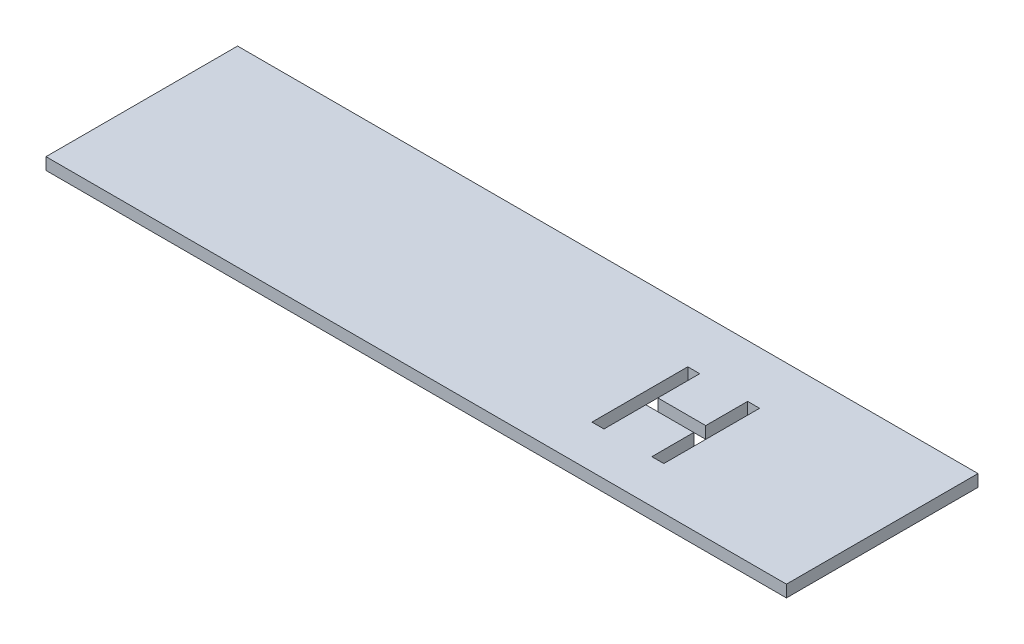
ISO-10303-21;
HEADER;
FILE_DESCRIPTION(('STEP AP214'),'2;1');
FILE_NAME('part.step','',(''),(''),'','','');
FILE_SCHEMA(('AUTOMOTIVE_DESIGN { 1 0 10303 214 1 1 1 1 }'));
ENDSEC;
DATA;
#1=APPLICATION_CONTEXT('core data for automotive mechanical design processes');
#2=APPLICATION_PROTOCOL_DEFINITION('international standard','automotive_design',2000,#1);
#3=PRODUCT_CONTEXT('',#1,'mechanical');
#4=PRODUCT('Part','Part','',(#3));
#5=PRODUCT_RELATED_PRODUCT_CATEGORY('part','',(#4));
#6=PRODUCT_DEFINITION_FORMATION('','',#4);
#7=PRODUCT_DEFINITION_CONTEXT('part definition',#1,'design');
#8=PRODUCT_DEFINITION('design','',#6,#7);
#9=PRODUCT_DEFINITION_SHAPE('','',#8);
#10=(LENGTH_UNIT() NAMED_UNIT(*) SI_UNIT(.MILLI.,.METRE.));
#11=(NAMED_UNIT(*) PLANE_ANGLE_UNIT() SI_UNIT($,.RADIAN.));
#12=(NAMED_UNIT(*) SI_UNIT($,.STERADIAN.) SOLID_ANGLE_UNIT());
#13=UNCERTAINTY_MEASURE_WITH_UNIT(LENGTH_MEASURE(1.E-05),#10,'distance_accuracy_value','');
#14=(GEOMETRIC_REPRESENTATION_CONTEXT(3) GLOBAL_UNCERTAINTY_ASSIGNED_CONTEXT((#13)) GLOBAL_UNIT_ASSIGNED_CONTEXT((#10,
#11,#12)) REPRESENTATION_CONTEXT('',''));
#15=CARTESIAN_POINT('',(0.,0.,0.));
#16=DIRECTION('',(0.,0.,1.));
#17=DIRECTION('',(1.,0.,0.));
#18=AXIS2_PLACEMENT_3D('',#15,#16,#17);
#19=CARTESIAN_POINT('',(0.,3.175,0.));
#20=DIRECTION('',(1.,0.,0.));
#21=DIRECTION('',(0.,0.,-1.));
#22=AXIS2_PLACEMENT_3D('',#19,#20,#21);
#23=PLANE('',#22);
#24=DIRECTION('',(0.,0.,1.));
#25=VECTOR('',#24,1.);
#26=CARTESIAN_POINT('',(0.,0.,0.));
#27=LINE('',#26,#25);
#28=CARTESIAN_POINT('',(0.,0.,-50.8));
#29=VERTEX_POINT('',#28);
#30=CARTESIAN_POINT('',(0.,0.,0.));
#31=VERTEX_POINT('',#30);
#32=EDGE_CURVE('E294',#29,#31,#27,.T.);
#33=ORIENTED_EDGE('',*,*,#32,.T.);
#34=DIRECTION('',(0.,-1.,0.));
#35=VECTOR('',#34,1.);
#36=CARTESIAN_POINT('',(0.,3.175,0.));
#37=LINE('',#36,#35);
#38=CARTESIAN_POINT('',(0.,3.175,0.));
#39=VERTEX_POINT('',#38);
#40=EDGE_CURVE('E11',#39,#31,#37,.T.);
#41=ORIENTED_EDGE('',*,*,#40,.F.);
#42=DIRECTION('',(0.,0.,1.));
#43=VECTOR('',#42,1.);
#44=CARTESIAN_POINT('',(0.,3.175,0.));
#45=LINE('',#44,#43);
#46=CARTESIAN_POINT('',(0.,3.175,-50.8));
#47=VERTEX_POINT('',#46);
#48=EDGE_CURVE('E295',#47,#39,#45,.T.);
#49=ORIENTED_EDGE('',*,*,#48,.F.);
#50=DIRECTION('',(0.,-1.,0.));
#51=VECTOR('',#50,1.);
#52=CARTESIAN_POINT('',(0.,3.175,-50.8));
#53=LINE('',#52,#51);
#54=EDGE_CURVE('E309',#47,#29,#53,.T.);
#55=ORIENTED_EDGE('',*,*,#54,.T.);
#56=EDGE_LOOP('',(#33,#41,#49,#55));
#57=FACE_BOUND('',#56,.T.);
#58=ADVANCED_FACE('F43',(#57),#23,.F.);
#59=CARTESIAN_POINT('',(0.,3.175,0.));
#60=DIRECTION('',(0.,0.,-1.));
#61=DIRECTION('',(-1.,0.,0.));
#62=AXIS2_PLACEMENT_3D('',#59,#60,#61);
#63=PLANE('',#62);
#64=DIRECTION('',(1.,0.,0.));
#65=VECTOR('',#64,1.);
#66=CARTESIAN_POINT('',(0.,0.,0.));
#67=LINE('',#66,#65);
#68=CARTESIAN_POINT('',(196.342,0.,0.));
#69=VERTEX_POINT('',#68);
#70=EDGE_CURVE('E313',#31,#69,#67,.T.);
#71=ORIENTED_EDGE('',*,*,#70,.T.);
#72=DIRECTION('',(0.,-1.,0.));
#73=VECTOR('',#72,1.);
#74=CARTESIAN_POINT('',(196.342,3.175,0.));
#75=LINE('',#74,#73);
#76=CARTESIAN_POINT('',(196.342,3.175,0.));
#77=VERTEX_POINT('',#76);
#78=EDGE_CURVE('E51',#77,#69,#75,.T.);
#79=ORIENTED_EDGE('',*,*,#78,.F.);
#80=DIRECTION('',(1.,0.,0.));
#81=VECTOR('',#80,1.);
#82=CARTESIAN_POINT('',(0.,3.175,0.));
#83=LINE('',#82,#81);
#84=EDGE_CURVE('E299',#39,#77,#83,.T.);
#85=ORIENTED_EDGE('',*,*,#84,.F.);
#86=ORIENTED_EDGE('',*,*,#40,.T.);
#87=EDGE_LOOP('',(#71,#79,#85,#86));
#88=FACE_BOUND('',#87,.T.);
#89=ADVANCED_FACE('F348',(#88),#63,.F.);
#90=CARTESIAN_POINT('',(196.342,3.175,0.));
#91=DIRECTION('',(-1.,0.,0.));
#92=DIRECTION('',(0.,0.,1.));
#93=AXIS2_PLACEMENT_3D('',#90,#91,#92);
#94=PLANE('',#93);
#95=DIRECTION('',(0.,0.,-1.));
#96=VECTOR('',#95,1.);
#97=CARTESIAN_POINT('',(196.342,0.,0.));
#98=LINE('',#97,#96);
#99=CARTESIAN_POINT('',(196.342,0.,-50.8));
#100=VERTEX_POINT('',#99);
#101=EDGE_CURVE('E316',#69,#100,#98,.T.);
#102=ORIENTED_EDGE('',*,*,#101,.T.);
#103=DIRECTION('',(0.,-1.,0.));
#104=VECTOR('',#103,1.);
#105=CARTESIAN_POINT('',(196.342,3.175,-50.8));
#106=LINE('',#105,#104);
#107=CARTESIAN_POINT('',(196.342,3.175,-50.8));
#108=VERTEX_POINT('',#107);
#109=EDGE_CURVE('E324',#108,#100,#106,.T.);
#110=ORIENTED_EDGE('',*,*,#109,.F.);
#111=DIRECTION('',(0.,0.,-1.));
#112=VECTOR('',#111,1.);
#113=CARTESIAN_POINT('',(196.342,3.175,0.));
#114=LINE('',#113,#112);
#115=EDGE_CURVE('E303',#77,#108,#114,.T.);
#116=ORIENTED_EDGE('',*,*,#115,.F.);
#117=ORIENTED_EDGE('',*,*,#78,.T.);
#118=EDGE_LOOP('',(#102,#110,#116,#117));
#119=FACE_BOUND('',#118,.T.);
#120=ADVANCED_FACE('F334',(#119),#94,.F.);
#121=CARTESIAN_POINT('',(0.,3.175,-50.8));
#122=DIRECTION('',(0.,0.,1.));
#123=DIRECTION('',(1.,0.,0.));
#124=AXIS2_PLACEMENT_3D('',#121,#122,#123);
#125=PLANE('',#124);
#126=DIRECTION('',(-1.,0.,0.));
#127=VECTOR('',#126,1.);
#128=CARTESIAN_POINT('',(0.,0.,-50.8));
#129=LINE('',#128,#127);
#130=EDGE_CURVE('E300',#100,#29,#129,.T.);
#131=ORIENTED_EDGE('',*,*,#130,.T.);
#132=ORIENTED_EDGE('',*,*,#54,.F.);
#133=DIRECTION('',(-1.,0.,0.));
#134=VECTOR('',#133,1.);
#135=CARTESIAN_POINT('',(0.,3.175,-50.8));
#136=LINE('',#135,#134);
#137=EDGE_CURVE('E306',#108,#47,#136,.T.);
#138=ORIENTED_EDGE('',*,*,#137,.F.);
#139=ORIENTED_EDGE('',*,*,#109,.T.);
#140=EDGE_LOOP('',(#131,#132,#138,#139));
#141=FACE_BOUND('',#140,.T.);
#142=ADVANCED_FACE('F341',(#141),#125,.F.);
#143=CARTESIAN_POINT('',(0.,3.175,0.));
#144=DIRECTION('',(0.,-1.,0.));
#145=DIRECTION('',(0.,0.,-1.));
#146=AXIS2_PLACEMENT_3D('',#143,#144,#145);
#147=PLANE('',#146);
#148=DIRECTION('',(-1.,0.,0.));
#149=VECTOR('',#148,1.);
#150=CARTESIAN_POINT('',(0.,3.175,-11.43));
#151=LINE('',#150,#149);
#152=CARTESIAN_POINT('',(136.525,3.175,-11.43));
#153=VERTEX_POINT('',#152);
#154=CARTESIAN_POINT('',(133.35,3.175,-11.43));
#155=VERTEX_POINT('',#154);
#156=EDGE_CURVE('E286',#153,#155,#151,.T.);
#157=ORIENTED_EDGE('',*,*,#156,.T.);
#158=DIRECTION('',(0.,0.,-1.));
#159=VECTOR('',#158,1.);
#160=CARTESIAN_POINT('',(133.35,3.175,0.));
#161=LINE('',#160,#159);
#162=CARTESIAN_POINT('',(133.35,3.175,-36.83));
#163=VERTEX_POINT('',#162);
#164=EDGE_CURVE('E290',#155,#163,#161,.T.);
#165=ORIENTED_EDGE('',*,*,#164,.T.);
#166=DIRECTION('',(1.,0.,0.));
#167=VECTOR('',#166,1.);
#168=CARTESIAN_POINT('',(0.,3.175,-36.83));
#169=LINE('',#168,#167);
#170=CARTESIAN_POINT('',(136.525,3.175,-36.83));
#171=VERTEX_POINT('',#170);
#172=EDGE_CURVE('E221',#163,#171,#169,.T.);
#173=ORIENTED_EDGE('',*,*,#172,.T.);
#174=DIRECTION('',(0.,0.,1.));
#175=VECTOR('',#174,1.);
#176=CARTESIAN_POINT('',(136.525,3.175,-3.40997071849155E-13));
#177=LINE('',#176,#175);
#178=CARTESIAN_POINT('',(136.525,3.175,-25.7175));
#179=VERTEX_POINT('',#178);
#180=EDGE_CURVE('E162',#171,#179,#177,.T.);
#181=ORIENTED_EDGE('',*,*,#180,.T.);
#182=DIRECTION('',(1.,0.,0.));
#183=VECTOR('',#182,1.);
#184=CARTESIAN_POINT('',(0.,3.175,-25.7175));
#185=LINE('',#184,#183);
#186=CARTESIAN_POINT('',(149.225,3.175,-25.7175));
#187=VERTEX_POINT('',#186);
#188=EDGE_CURVE('E254',#179,#187,#185,.T.);
#189=ORIENTED_EDGE('',*,*,#188,.T.);
#190=DIRECTION('',(0.,0.,-1.));
#191=VECTOR('',#190,1.);
#192=CARTESIAN_POINT('',(149.225,3.175,0.));
#193=LINE('',#192,#191);
#194=CARTESIAN_POINT('',(149.225,3.175,-36.83));
#195=VERTEX_POINT('',#194);
#196=EDGE_CURVE('E258',#187,#195,#193,.T.);
#197=ORIENTED_EDGE('',*,*,#196,.T.);
#198=DIRECTION('',(1.,0.,0.));
#199=VECTOR('',#198,1.);
#200=CARTESIAN_POINT('',(0.,3.175,-36.83));
#201=LINE('',#200,#199);
#202=CARTESIAN_POINT('',(152.4,3.175,-36.83));
#203=VERTEX_POINT('',#202);
#204=EDGE_CURVE('E262',#195,#203,#201,.T.);
#205=ORIENTED_EDGE('',*,*,#204,.T.);
#206=DIRECTION('',(0.,0.,1.));
#207=VECTOR('',#206,1.);
#208=CARTESIAN_POINT('',(152.4,3.175,0.));
#209=LINE('',#208,#207);
#210=CARTESIAN_POINT('',(152.4,3.175,-11.43));
#211=VERTEX_POINT('',#210);
#212=EDGE_CURVE('E266',#203,#211,#209,.T.);
#213=ORIENTED_EDGE('',*,*,#212,.T.);
#214=DIRECTION('',(-1.,0.,0.));
#215=VECTOR('',#214,1.);
#216=CARTESIAN_POINT('',(0.,3.175,-11.43));
#217=LINE('',#216,#215);
#218=CARTESIAN_POINT('',(149.225,3.175,-11.43));
#219=VERTEX_POINT('',#218);
#220=EDGE_CURVE('E270',#211,#219,#217,.T.);
#221=ORIENTED_EDGE('',*,*,#220,.T.);
#222=DIRECTION('',(0.,0.,-1.));
#223=VECTOR('',#222,1.);
#224=CARTESIAN_POINT('',(149.225,3.175,0.));
#225=LINE('',#224,#223);
#226=CARTESIAN_POINT('',(149.225,3.175,-22.5425));
#227=VERTEX_POINT('',#226);
#228=EDGE_CURVE('E274',#219,#227,#225,.T.);
#229=ORIENTED_EDGE('',*,*,#228,.T.);
#230=DIRECTION('',(-1.,0.,0.));
#231=VECTOR('',#230,1.);
#232=CARTESIAN_POINT('',(0.,3.175,-22.5425));
#233=LINE('',#232,#231);
#234=CARTESIAN_POINT('',(136.525,3.175,-22.5425));
#235=VERTEX_POINT('',#234);
#236=EDGE_CURVE('E278',#227,#235,#233,.T.);
#237=ORIENTED_EDGE('',*,*,#236,.T.);
#238=DIRECTION('',(0.,0.,1.));
#239=VECTOR('',#238,1.);
#240=CARTESIAN_POINT('',(136.525,3.175,-3.40997071849155E-13));
#241=LINE('',#240,#239);
#242=EDGE_CURVE('E282',#235,#153,#241,.T.);
#243=ORIENTED_EDGE('',*,*,#242,.T.);
#244=EDGE_LOOP('',(#157,#165,#173,#181,#189,#197,#205,#213,#221,#229,#237,#243));
#245=FACE_BOUND('',#244,.T.);
#246=ORIENTED_EDGE('',*,*,#48,.T.);
#247=ORIENTED_EDGE('',*,*,#84,.T.);
#248=ORIENTED_EDGE('',*,*,#115,.T.);
#249=ORIENTED_EDGE('',*,*,#137,.T.);
#250=EDGE_LOOP('',(#246,#247,#248,#249));
#251=FACE_BOUND('',#250,.T.);
#252=ADVANCED_FACE('F347',(#245,#251),#147,.F.);
#253=CARTESIAN_POINT('',(0.,0.,0.));
#254=DIRECTION('',(0.,-1.,0.));
#255=DIRECTION('',(0.,0.,-1.));
#256=AXIS2_PLACEMENT_3D('',#253,#254,#255);
#257=PLANE('',#256);
#258=DIRECTION('',(0.,0.,-1.));
#259=VECTOR('',#258,1.);
#260=CARTESIAN_POINT('',(133.35,0.,-11.43));
#261=LINE('',#260,#259);
#262=CARTESIAN_POINT('',(133.35,0.,-11.43));
#263=VERTEX_POINT('',#262);
#264=CARTESIAN_POINT('',(133.35,0.,-36.83));
#265=VERTEX_POINT('',#264);
#266=EDGE_CURVE('E66',#263,#265,#261,.T.);
#267=ORIENTED_EDGE('',*,*,#266,.F.);
#268=DIRECTION('',(-1.,0.,0.));
#269=VECTOR('',#268,1.);
#270=CARTESIAN_POINT('',(133.35,0.,-11.43));
#271=LINE('',#270,#269);
#272=CARTESIAN_POINT('',(136.525,0.,-11.43));
#273=VERTEX_POINT('',#272);
#274=EDGE_CURVE('E214',#273,#263,#271,.T.);
#275=ORIENTED_EDGE('',*,*,#274,.F.);
#276=DIRECTION('',(0.,0.,1.));
#277=VECTOR('',#276,1.);
#278=CARTESIAN_POINT('',(136.525,0.,-11.43));
#279=LINE('',#278,#277);
#280=CARTESIAN_POINT('',(136.525,0.,-22.5425));
#281=VERTEX_POINT('',#280);
#282=EDGE_CURVE('E210',#281,#273,#279,.T.);
#283=ORIENTED_EDGE('',*,*,#282,.F.);
#284=DIRECTION('',(-1.,0.,0.));
#285=VECTOR('',#284,1.);
#286=CARTESIAN_POINT('',(136.525,0.,-22.5425));
#287=LINE('',#286,#285);
#288=CARTESIAN_POINT('',(149.225,0.,-22.5425));
#289=VERTEX_POINT('',#288);
#290=EDGE_CURVE('E206',#289,#281,#287,.T.);
#291=ORIENTED_EDGE('',*,*,#290,.F.);
#292=DIRECTION('',(0.,0.,-1.));
#293=VECTOR('',#292,1.);
#294=CARTESIAN_POINT('',(149.225,0.,-11.43));
#295=LINE('',#294,#293);
#296=CARTESIAN_POINT('',(149.225,0.,-11.43));
#297=VERTEX_POINT('',#296);
#298=EDGE_CURVE('E202',#297,#289,#295,.T.);
#299=ORIENTED_EDGE('',*,*,#298,.F.);
#300=DIRECTION('',(-1.,0.,0.));
#301=VECTOR('',#300,1.);
#302=CARTESIAN_POINT('',(149.225,0.,-11.43));
#303=LINE('',#302,#301);
#304=CARTESIAN_POINT('',(152.4,0.,-11.43));
#305=VERTEX_POINT('',#304);
#306=EDGE_CURVE('E198',#305,#297,#303,.T.);
#307=ORIENTED_EDGE('',*,*,#306,.F.);
#308=DIRECTION('',(0.,0.,1.));
#309=VECTOR('',#308,1.);
#310=CARTESIAN_POINT('',(152.4,0.,-11.43));
#311=LINE('',#310,#309);
#312=CARTESIAN_POINT('',(152.4,0.,-36.83));
#313=VERTEX_POINT('',#312);
#314=EDGE_CURVE('E194',#313,#305,#311,.T.);
#315=ORIENTED_EDGE('',*,*,#314,.F.);
#316=DIRECTION('',(1.,0.,0.));
#317=VECTOR('',#316,1.);
#318=CARTESIAN_POINT('',(149.225,0.,-36.83));
#319=LINE('',#318,#317);
#320=CARTESIAN_POINT('',(149.225,0.,-36.83));
#321=VERTEX_POINT('',#320);
#322=EDGE_CURVE('E190',#321,#313,#319,.T.);
#323=ORIENTED_EDGE('',*,*,#322,.F.);
#324=DIRECTION('',(0.,0.,-1.));
#325=VECTOR('',#324,1.);
#326=CARTESIAN_POINT('',(149.225,0.,-25.7175));
#327=LINE('',#326,#325);
#328=CARTESIAN_POINT('',(149.225,0.,-25.7175));
#329=VERTEX_POINT('',#328);
#330=EDGE_CURVE('E183',#329,#321,#327,.T.);
#331=ORIENTED_EDGE('',*,*,#330,.F.);
#332=DIRECTION('',(1.,0.,0.));
#333=VECTOR('',#332,1.);
#334=CARTESIAN_POINT('',(136.525,0.,-25.7175));
#335=LINE('',#334,#333);
#336=CARTESIAN_POINT('',(136.525,0.,-25.7175));
#337=VERTEX_POINT('',#336);
#338=EDGE_CURVE('E178',#337,#329,#335,.T.);
#339=ORIENTED_EDGE('',*,*,#338,.F.);
#340=DIRECTION('',(0.,0.,1.));
#341=VECTOR('',#340,1.);
#342=CARTESIAN_POINT('',(136.525,0.,-25.7175));
#343=LINE('',#342,#341);
#344=CARTESIAN_POINT('',(136.525,0.,-36.83));
#345=VERTEX_POINT('',#344);
#346=EDGE_CURVE('E159',#345,#337,#343,.T.);
#347=ORIENTED_EDGE('',*,*,#346,.F.);
#348=DIRECTION('',(1.,0.,0.));
#349=VECTOR('',#348,1.);
#350=CARTESIAN_POINT('',(133.35,0.,-36.83));
#351=LINE('',#350,#349);
#352=EDGE_CURVE('E169',#265,#345,#351,.T.);
#353=ORIENTED_EDGE('',*,*,#352,.F.);
#354=EDGE_LOOP('',(#267,#275,#283,#291,#299,#307,#315,#323,#331,#339,#347,#353));
#355=FACE_BOUND('',#354,.T.);
#356=ORIENTED_EDGE('',*,*,#32,.F.);
#357=ORIENTED_EDGE('',*,*,#130,.F.);
#358=ORIENTED_EDGE('',*,*,#101,.F.);
#359=ORIENTED_EDGE('',*,*,#70,.F.);
#360=EDGE_LOOP('',(#356,#357,#358,#359));
#361=FACE_BOUND('',#360,.T.);
#362=ADVANCED_FACE('F174',(#355,#361),#257,.T.);
#363=CARTESIAN_POINT('',(133.35,7.62,-11.43));
#364=DIRECTION('',(-1.,0.,0.));
#365=DIRECTION('',(0.,0.,1.));
#366=AXIS2_PLACEMENT_3D('',#363,#364,#365);
#367=PLANE('',#366);
#368=DIRECTION('',(0.,-1.,0.));
#369=VECTOR('',#368,1.);
#370=CARTESIAN_POINT('',(133.35,7.62,-11.43));
#371=LINE('',#370,#369);
#372=EDGE_CURVE('E218',#155,#263,#371,.T.);
#373=ORIENTED_EDGE('',*,*,#372,.T.);
#374=ORIENTED_EDGE('',*,*,#266,.T.);
#375=DIRECTION('',(0.,-1.,0.));
#376=VECTOR('',#375,1.);
#377=CARTESIAN_POINT('',(133.35,7.62,-36.83));
#378=LINE('',#377,#376);
#379=EDGE_CURVE('E166',#163,#265,#378,.T.);
#380=ORIENTED_EDGE('',*,*,#379,.F.);
#381=ORIENTED_EDGE('',*,*,#164,.F.);
#382=EDGE_LOOP('',(#373,#374,#380,#381));
#383=FACE_BOUND('',#382,.T.);
#384=ADVANCED_FACE('F360',(#383),#367,.F.);
#385=CARTESIAN_POINT('',(133.35,7.62,-11.43));
#386=DIRECTION('',(0.,0.,1.));
#387=DIRECTION('',(1.,0.,0.));
#388=AXIS2_PLACEMENT_3D('',#385,#386,#387);
#389=PLANE('',#388);
#390=DIRECTION('',(0.,-1.,0.));
#391=VECTOR('',#390,1.);
#392=CARTESIAN_POINT('',(136.525,7.62,-11.43));
#393=LINE('',#392,#391);
#394=EDGE_CURVE('E222',#153,#273,#393,.T.);
#395=ORIENTED_EDGE('',*,*,#394,.T.);
#396=ORIENTED_EDGE('',*,*,#274,.T.);
#397=ORIENTED_EDGE('',*,*,#372,.F.);
#398=ORIENTED_EDGE('',*,*,#156,.F.);
#399=EDGE_LOOP('',(#395,#396,#397,#398));
#400=FACE_BOUND('',#399,.T.);
#401=ADVANCED_FACE('F366',(#400),#389,.F.);
#402=CARTESIAN_POINT('',(136.525,7.62,-11.43));
#403=DIRECTION('',(1.,0.,0.));
#404=DIRECTION('',(0.,0.,-1.));
#405=AXIS2_PLACEMENT_3D('',#402,#403,#404);
#406=PLANE('',#405);
#407=DIRECTION('',(0.,-1.,0.));
#408=VECTOR('',#407,1.);
#409=CARTESIAN_POINT('',(136.525,7.62,-22.5425));
#410=LINE('',#409,#408);
#411=EDGE_CURVE('E225',#235,#281,#410,.T.);
#412=ORIENTED_EDGE('',*,*,#411,.T.);
#413=ORIENTED_EDGE('',*,*,#282,.T.);
#414=ORIENTED_EDGE('',*,*,#394,.F.);
#415=ORIENTED_EDGE('',*,*,#242,.F.);
#416=EDGE_LOOP('',(#412,#413,#414,#415));
#417=FACE_BOUND('',#416,.T.);
#418=ADVANCED_FACE('F398',(#417),#406,.F.);
#419=CARTESIAN_POINT('',(136.525,7.62,-22.5425));
#420=DIRECTION('',(0.,0.,1.));
#421=DIRECTION('',(1.,0.,0.));
#422=AXIS2_PLACEMENT_3D('',#419,#420,#421);
#423=PLANE('',#422);
#424=DIRECTION('',(0.,-1.,0.));
#425=VECTOR('',#424,1.);
#426=CARTESIAN_POINT('',(149.225,7.62,-22.5425));
#427=LINE('',#426,#425);
#428=EDGE_CURVE('E228',#227,#289,#427,.T.);
#429=ORIENTED_EDGE('',*,*,#428,.T.);
#430=ORIENTED_EDGE('',*,*,#290,.T.);
#431=ORIENTED_EDGE('',*,*,#411,.F.);
#432=ORIENTED_EDGE('',*,*,#236,.F.);
#433=EDGE_LOOP('',(#429,#430,#431,#432));
#434=FACE_BOUND('',#433,.T.);
#435=ADVANCED_FACE('F394',(#434),#423,.F.);
#436=CARTESIAN_POINT('',(149.225,7.62,-11.43));
#437=DIRECTION('',(-1.,0.,0.));
#438=DIRECTION('',(0.,0.,1.));
#439=AXIS2_PLACEMENT_3D('',#436,#437,#438);
#440=PLANE('',#439);
#441=DIRECTION('',(0.,-1.,0.));
#442=VECTOR('',#441,1.);
#443=CARTESIAN_POINT('',(149.225,7.62,-11.43));
#444=LINE('',#443,#442);
#445=EDGE_CURVE('E231',#219,#297,#444,.T.);
#446=ORIENTED_EDGE('',*,*,#445,.T.);
#447=ORIENTED_EDGE('',*,*,#298,.T.);
#448=ORIENTED_EDGE('',*,*,#428,.F.);
#449=ORIENTED_EDGE('',*,*,#228,.F.);
#450=EDGE_LOOP('',(#446,#447,#448,#449));
#451=FACE_BOUND('',#450,.T.);
#452=ADVANCED_FACE('F390',(#451),#440,.F.);
#453=CARTESIAN_POINT('',(149.225,7.62,-11.43));
#454=DIRECTION('',(0.,0.,1.));
#455=DIRECTION('',(1.,0.,0.));
#456=AXIS2_PLACEMENT_3D('',#453,#454,#455);
#457=PLANE('',#456);
#458=DIRECTION('',(0.,-1.,0.));
#459=VECTOR('',#458,1.);
#460=CARTESIAN_POINT('',(152.4,7.62,-11.43));
#461=LINE('',#460,#459);
#462=EDGE_CURVE('E234',#211,#305,#461,.T.);
#463=ORIENTED_EDGE('',*,*,#462,.T.);
#464=ORIENTED_EDGE('',*,*,#306,.T.);
#465=ORIENTED_EDGE('',*,*,#445,.F.);
#466=ORIENTED_EDGE('',*,*,#220,.F.);
#467=EDGE_LOOP('',(#463,#464,#465,#466));
#468=FACE_BOUND('',#467,.T.);
#469=ADVANCED_FACE('F386',(#468),#457,.F.);
#470=CARTESIAN_POINT('',(152.4,7.62,-11.43));
#471=DIRECTION('',(1.,0.,0.));
#472=DIRECTION('',(0.,0.,-1.));
#473=AXIS2_PLACEMENT_3D('',#470,#471,#472);
#474=PLANE('',#473);
#475=DIRECTION('',(0.,-1.,0.));
#476=VECTOR('',#475,1.);
#477=CARTESIAN_POINT('',(152.4,7.62,-36.83));
#478=LINE('',#477,#476);
#479=EDGE_CURVE('E237',#203,#313,#478,.T.);
#480=ORIENTED_EDGE('',*,*,#479,.T.);
#481=ORIENTED_EDGE('',*,*,#314,.T.);
#482=ORIENTED_EDGE('',*,*,#462,.F.);
#483=ORIENTED_EDGE('',*,*,#212,.F.);
#484=EDGE_LOOP('',(#480,#481,#482,#483));
#485=FACE_BOUND('',#484,.T.);
#486=ADVANCED_FACE('F382',(#485),#474,.F.);
#487=CARTESIAN_POINT('',(149.225,7.62,-36.83));
#488=DIRECTION('',(0.,0.,-1.));
#489=DIRECTION('',(-1.,0.,0.));
#490=AXIS2_PLACEMENT_3D('',#487,#488,#489);
#491=PLANE('',#490);
#492=DIRECTION('',(0.,-1.,0.));
#493=VECTOR('',#492,1.);
#494=CARTESIAN_POINT('',(149.225,7.62,-36.83));
#495=LINE('',#494,#493);
#496=EDGE_CURVE('E240',#195,#321,#495,.T.);
#497=ORIENTED_EDGE('',*,*,#496,.T.);
#498=ORIENTED_EDGE('',*,*,#322,.T.);
#499=ORIENTED_EDGE('',*,*,#479,.F.);
#500=ORIENTED_EDGE('',*,*,#204,.F.);
#501=EDGE_LOOP('',(#497,#498,#499,#500));
#502=FACE_BOUND('',#501,.T.);
#503=ADVANCED_FACE('F378',(#502),#491,.F.);
#504=CARTESIAN_POINT('',(149.225,7.62,-25.7175));
#505=DIRECTION('',(-1.,0.,0.));
#506=DIRECTION('',(0.,0.,1.));
#507=AXIS2_PLACEMENT_3D('',#504,#505,#506);
#508=PLANE('',#507);
#509=DIRECTION('',(0.,-1.,0.));
#510=VECTOR('',#509,1.);
#511=CARTESIAN_POINT('',(149.225,7.62,-25.7175));
#512=LINE('',#511,#510);
#513=EDGE_CURVE('E243',#187,#329,#512,.T.);
#514=ORIENTED_EDGE('',*,*,#513,.T.);
#515=ORIENTED_EDGE('',*,*,#330,.T.);
#516=ORIENTED_EDGE('',*,*,#496,.F.);
#517=ORIENTED_EDGE('',*,*,#196,.F.);
#518=EDGE_LOOP('',(#514,#515,#516,#517));
#519=FACE_BOUND('',#518,.T.);
#520=ADVANCED_FACE('F374',(#519),#508,.F.);
#521=CARTESIAN_POINT('',(136.525,7.62,-25.7175));
#522=DIRECTION('',(0.,0.,-1.));
#523=DIRECTION('',(-1.,0.,0.));
#524=AXIS2_PLACEMENT_3D('',#521,#522,#523);
#525=PLANE('',#524);
#526=DIRECTION('',(0.,-1.,0.));
#527=VECTOR('',#526,1.);
#528=CARTESIAN_POINT('',(136.525,7.62,-25.7175));
#529=LINE('',#528,#527);
#530=EDGE_CURVE('E165',#179,#337,#529,.T.);
#531=ORIENTED_EDGE('',*,*,#530,.T.);
#532=ORIENTED_EDGE('',*,*,#338,.T.);
#533=ORIENTED_EDGE('',*,*,#513,.F.);
#534=ORIENTED_EDGE('',*,*,#188,.F.);
#535=EDGE_LOOP('',(#531,#532,#533,#534));
#536=FACE_BOUND('',#535,.T.);
#537=ADVANCED_FACE('F371',(#536),#525,.F.);
#538=CARTESIAN_POINT('',(136.525,7.62,-25.7175));
#539=DIRECTION('',(1.,0.,0.));
#540=DIRECTION('',(0.,0.,-1.));
#541=AXIS2_PLACEMENT_3D('',#538,#539,#540);
#542=PLANE('',#541);
#543=DIRECTION('',(0.,-1.,0.));
#544=VECTOR('',#543,1.);
#545=CARTESIAN_POINT('',(136.525,7.62,-36.83));
#546=LINE('',#545,#544);
#547=EDGE_CURVE('E58',#171,#345,#546,.T.);
#548=ORIENTED_EDGE('',*,*,#547,.T.);
#549=ORIENTED_EDGE('',*,*,#346,.T.);
#550=ORIENTED_EDGE('',*,*,#530,.F.);
#551=ORIENTED_EDGE('',*,*,#180,.F.);
#552=EDGE_LOOP('',(#548,#549,#550,#551));
#553=FACE_BOUND('',#552,.T.);
#554=ADVANCED_FACE('F156',(#553),#542,.F.);
#555=CARTESIAN_POINT('',(133.35,7.62,-36.83));
#556=DIRECTION('',(0.,0.,-1.));
#557=DIRECTION('',(-1.,0.,0.));
#558=AXIS2_PLACEMENT_3D('',#555,#556,#557);
#559=PLANE('',#558);
#560=ORIENTED_EDGE('',*,*,#379,.T.);
#561=ORIENTED_EDGE('',*,*,#352,.T.);
#562=ORIENTED_EDGE('',*,*,#547,.F.);
#563=ORIENTED_EDGE('',*,*,#172,.F.);
#564=EDGE_LOOP('',(#560,#561,#562,#563));
#565=FACE_BOUND('',#564,.T.);
#566=ADVANCED_FACE('F170',(#565),#559,.F.);
#567=CLOSED_SHELL('',(#58,#89,#120,#142,#252,#362,#384,#401,#418,#435,#452,#469,#486,#503,#520,
#537,#554,#566));
#568=MANIFOLD_SOLID_BREP('B2',#567);
#569=ADVANCED_BREP_SHAPE_REPRESENTATION('',(#18,#568),#14);
#570=SHAPE_DEFINITION_REPRESENTATION(#9,#569);
ENDSEC;
END-ISO-10303-21;
